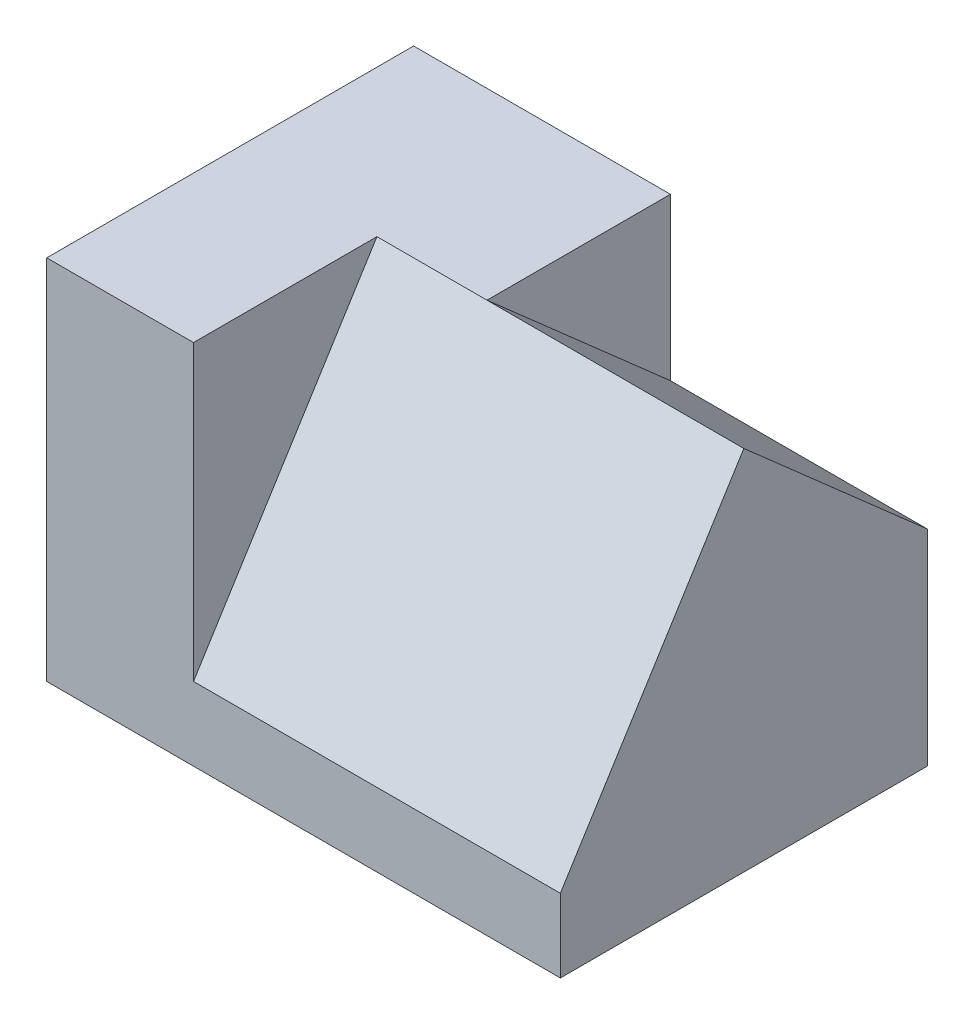
ISO-10303-21;
HEADER;
FILE_DESCRIPTION(('STEP AP214'),'2;1');
FILE_NAME('part.step','',(''),(''),'','','');
FILE_SCHEMA(('AUTOMOTIVE_DESIGN { 1 0 10303 214 1 1 1 1 }'));
ENDSEC;
DATA;
#1=APPLICATION_CONTEXT('core data for automotive mechanical design processes');
#2=APPLICATION_PROTOCOL_DEFINITION('international standard','automotive_design',2000,#1);
#3=PRODUCT_CONTEXT('',#1,'mechanical');
#4=PRODUCT('Part','Part','',(#3));
#5=PRODUCT_RELATED_PRODUCT_CATEGORY('part','',(#4));
#6=PRODUCT_DEFINITION_FORMATION('','',#4);
#7=PRODUCT_DEFINITION_CONTEXT('part definition',#1,'design');
#8=PRODUCT_DEFINITION('design','',#6,#7);
#9=PRODUCT_DEFINITION_SHAPE('','',#8);
#10=(LENGTH_UNIT() NAMED_UNIT(*) SI_UNIT(.MILLI.,.METRE.));
#11=(NAMED_UNIT(*) PLANE_ANGLE_UNIT() SI_UNIT($,.RADIAN.));
#12=(NAMED_UNIT(*) SI_UNIT($,.STERADIAN.) SOLID_ANGLE_UNIT());
#13=UNCERTAINTY_MEASURE_WITH_UNIT(LENGTH_MEASURE(1.E-05),#10,'distance_accuracy_value','');
#14=(GEOMETRIC_REPRESENTATION_CONTEXT(3) GLOBAL_UNCERTAINTY_ASSIGNED_CONTEXT((#13)) GLOBAL_UNIT_ASSIGNED_CONTEXT((#10,
#11,#12)) REPRESENTATION_CONTEXT('',''));
#15=CARTESIAN_POINT('',(0.,0.,0.));
#16=DIRECTION('',(0.,0.,1.));
#17=DIRECTION('',(1.,0.,0.));
#18=AXIS2_PLACEMENT_3D('',#15,#16,#17);
#19=CARTESIAN_POINT('',(0.,500.,-500.));
#20=DIRECTION('',(0.,0.,-1.));
#21=DIRECTION('',(-1.,0.,0.));
#22=AXIS2_PLACEMENT_3D('',#19,#20,#21);
#23=PLANE('',#22);
#24=DIRECTION('',(0.,-1.,0.));
#25=VECTOR('',#24,1.);
#26=CARTESIAN_POINT('',(350.,500.,-500.));
#27=LINE('',#26,#25);
#28=CARTESIAN_POINT('',(350.,500.,-500.));
#29=VERTEX_POINT('',#28);
#30=CARTESIAN_POINT('',(350.,280.,-500.));
#31=VERTEX_POINT('',#30);
#32=EDGE_CURVE('E104',#29,#31,#27,.T.);
#33=ORIENTED_EDGE('',*,*,#32,.T.);
#34=DIRECTION('',(-1.,0.,0.));
#35=VECTOR('',#34,1.);
#36=CARTESIAN_POINT('',(2818.73429638328,280.,-500.));
#37=LINE('',#36,#35);
#38=CARTESIAN_POINT('',(700.,280.,-500.));
#39=VERTEX_POINT('',#38);
#40=EDGE_CURVE('E141',#39,#31,#37,.T.);
#41=ORIENTED_EDGE('',*,*,#40,.F.);
#42=DIRECTION('',(0.,-1.,0.));
#43=VECTOR('',#42,1.);
#44=CARTESIAN_POINT('',(700.,500.,-500.));
#45=LINE('',#44,#43);
#46=CARTESIAN_POINT('',(700.,0.,-500.));
#47=VERTEX_POINT('',#46);
#48=EDGE_CURVE('E103',#39,#47,#45,.T.);
#49=ORIENTED_EDGE('',*,*,#48,.T.);
#50=DIRECTION('',(1.,0.,0.));
#51=VECTOR('',#50,1.);
#52=CARTESIAN_POINT('',(0.,0.,-500.));
#53=LINE('',#52,#51);
#54=CARTESIAN_POINT('',(0.,0.,-500.));
#55=VERTEX_POINT('',#54);
#56=EDGE_CURVE('E108',#55,#47,#53,.T.);
#57=ORIENTED_EDGE('',*,*,#56,.F.);
#58=DIRECTION('',(0.,-1.,0.));
#59=VECTOR('',#58,1.);
#60=CARTESIAN_POINT('',(0.,500.,-500.));
#61=LINE('',#60,#59);
#62=CARTESIAN_POINT('',(0.,500.,-500.));
#63=VERTEX_POINT('',#62);
#64=EDGE_CURVE('E133',#63,#55,#61,.T.);
#65=ORIENTED_EDGE('',*,*,#64,.F.);
#66=DIRECTION('',(1.,0.,0.));
#67=VECTOR('',#66,1.);
#68=CARTESIAN_POINT('',(0.,500.,-500.));
#69=LINE('',#68,#67);
#70=EDGE_CURVE('E117',#63,#29,#69,.T.);
#71=ORIENTED_EDGE('',*,*,#70,.T.);
#72=EDGE_LOOP('',(#33,#41,#49,#57,#65,#71));
#73=FACE_BOUND('',#72,.T.);
#74=ADVANCED_FACE('F33',(#73),#23,.T.);
#75=CARTESIAN_POINT('',(700.,500.,0.));
#76=DIRECTION('',(-1.,0.,0.));
#77=DIRECTION('',(0.,0.,1.));
#78=AXIS2_PLACEMENT_3D('',#75,#76,#77);
#79=PLANE('',#78);
#80=DIRECTION('',(0.,0.660627894892025,0.750713516922755));
#81=VECTOR('',#80,1.);
#82=CARTESIAN_POINT('',(700.,500.,-250.));
#83=LINE('',#82,#81);
#84=CARTESIAN_POINT('',(700.,500.,-250.));
#85=VERTEX_POINT('',#84);
#86=EDGE_CURVE('E93',#39,#85,#83,.T.);
#87=ORIENTED_EDGE('',*,*,#86,.T.);
#88=DIRECTION('',(0.,-0.847998304005088,0.52999894000318));
#89=VECTOR('',#88,1.);
#90=CARTESIAN_POINT('',(700.,387.640449438202,-179.775280898876));
#91=LINE('',#90,#89);
#92=CARTESIAN_POINT('',(700.,99.9999999999999,0.));
#93=VERTEX_POINT('',#92);
#94=EDGE_CURVE('E100',#85,#93,#91,.T.);
#95=ORIENTED_EDGE('',*,*,#94,.T.);
#96=DIRECTION('',(0.,-1.,0.));
#97=VECTOR('',#96,1.);
#98=CARTESIAN_POINT('',(700.,500.,0.));
#99=LINE('',#98,#97);
#100=CARTESIAN_POINT('',(700.,0.,0.));
#101=VERTEX_POINT('',#100);
#102=EDGE_CURVE('E137',#93,#101,#99,.T.);
#103=ORIENTED_EDGE('',*,*,#102,.T.);
#104=DIRECTION('',(0.,0.,-1.));
#105=VECTOR('',#104,1.);
#106=CARTESIAN_POINT('',(700.,0.,0.));
#107=LINE('',#106,#105);
#108=EDGE_CURVE('E111',#101,#47,#107,.T.);
#109=ORIENTED_EDGE('',*,*,#108,.T.);
#110=ORIENTED_EDGE('',*,*,#48,.F.);
#111=EDGE_LOOP('',(#87,#95,#103,#109,#110));
#112=FACE_BOUND('',#111,.T.);
#113=ADVANCED_FACE('F99',(#112),#79,.F.);
#114=CARTESIAN_POINT('',(0.,500.,0.));
#115=DIRECTION('',(-1.,0.,0.));
#116=DIRECTION('',(0.,0.,1.));
#117=AXIS2_PLACEMENT_3D('',#114,#115,#116);
#118=PLANE('',#117);
#119=DIRECTION('',(0.,0.,-1.));
#120=VECTOR('',#119,1.);
#121=CARTESIAN_POINT('',(0.,0.,0.));
#122=LINE('',#121,#120);
#123=CARTESIAN_POINT('',(0.,0.,0.));
#124=VERTEX_POINT('',#123);
#125=EDGE_CURVE('E121',#124,#55,#122,.T.);
#126=ORIENTED_EDGE('',*,*,#125,.F.);
#127=DIRECTION('',(0.,-1.,0.));
#128=VECTOR('',#127,1.);
#129=CARTESIAN_POINT('',(0.,500.,0.));
#130=LINE('',#129,#128);
#131=CARTESIAN_POINT('',(0.,500.,0.));
#132=VERTEX_POINT('',#131);
#133=EDGE_CURVE('E135',#132,#124,#130,.T.);
#134=ORIENTED_EDGE('',*,*,#133,.F.);
#135=DIRECTION('',(0.,0.,-1.));
#136=VECTOR('',#135,1.);
#137=CARTESIAN_POINT('',(0.,500.,0.));
#138=LINE('',#137,#136);
#139=EDGE_CURVE('E124',#132,#63,#138,.T.);
#140=ORIENTED_EDGE('',*,*,#139,.T.);
#141=ORIENTED_EDGE('',*,*,#64,.T.);
#142=EDGE_LOOP('',(#126,#134,#140,#141));
#143=FACE_BOUND('',#142,.T.);
#144=ADVANCED_FACE('F148',(#143),#118,.T.);
#145=CARTESIAN_POINT('',(0.,500.,0.));
#146=DIRECTION('',(0.,0.,-1.));
#147=DIRECTION('',(-1.,0.,0.));
#148=AXIS2_PLACEMENT_3D('',#145,#146,#147);
#149=PLANE('',#148);
#150=ORIENTED_EDGE('',*,*,#102,.F.);
#151=DIRECTION('',(-1.,0.,0.));
#152=VECTOR('',#151,1.);
#153=CARTESIAN_POINT('',(700.000012,99.9999999999999,0.));
#154=LINE('',#153,#152);
#155=CARTESIAN_POINT('',(200.,99.9999999999999,0.));
#156=VERTEX_POINT('',#155);
#157=EDGE_CURVE('E107',#93,#156,#154,.T.);
#158=ORIENTED_EDGE('',*,*,#157,.T.);
#159=DIRECTION('',(0.,-1.,0.));
#160=VECTOR('',#159,1.);
#161=CARTESIAN_POINT('',(200.,0.,0.));
#162=LINE('',#161,#160);
#163=CARTESIAN_POINT('',(200.,500.,0.));
#164=VERTEX_POINT('',#163);
#165=EDGE_CURVE('E113',#164,#156,#162,.T.);
#166=ORIENTED_EDGE('',*,*,#165,.F.);
#167=DIRECTION('',(1.,0.,0.));
#168=VECTOR('',#167,1.);
#169=CARTESIAN_POINT('',(0.,500.,0.));
#170=LINE('',#169,#168);
#171=EDGE_CURVE('E120',#132,#164,#170,.T.);
#172=ORIENTED_EDGE('',*,*,#171,.F.);
#173=ORIENTED_EDGE('',*,*,#133,.T.);
#174=DIRECTION('',(1.,0.,0.));
#175=VECTOR('',#174,1.);
#176=CARTESIAN_POINT('',(0.,0.,0.));
#177=LINE('',#176,#175);
#178=EDGE_CURVE('E128',#124,#101,#177,.T.);
#179=ORIENTED_EDGE('',*,*,#178,.T.);
#180=EDGE_LOOP('',(#150,#158,#166,#172,#173,#179));
#181=FACE_BOUND('',#180,.T.);
#182=ADVANCED_FACE('F170',(#181),#149,.F.);
#183=CARTESIAN_POINT('',(0.,500.,0.));
#184=DIRECTION('',(0.,1.,0.));
#185=DIRECTION('',(0.,0.,1.));
#186=AXIS2_PLACEMENT_3D('',#183,#184,#185);
#187=PLANE('',#186);
#188=DIRECTION('',(0.,0.,-1.));
#189=VECTOR('',#188,1.);
#190=CARTESIAN_POINT('',(350.,500.,0.));
#191=LINE('',#190,#189);
#192=CARTESIAN_POINT('',(350.,500.,-250.));
#193=VERTEX_POINT('',#192);
#194=EDGE_CURVE('E155',#193,#29,#191,.T.);
#195=ORIENTED_EDGE('',*,*,#194,.T.);
#196=ORIENTED_EDGE('',*,*,#70,.F.);
#197=ORIENTED_EDGE('',*,*,#139,.F.);
#198=ORIENTED_EDGE('',*,*,#171,.T.);
#199=DIRECTION('',(0.,0.,1.));
#200=VECTOR('',#199,1.);
#201=CARTESIAN_POINT('',(200.,500.,0.));
#202=LINE('',#201,#200);
#203=CARTESIAN_POINT('',(200.,500.,-250.));
#204=VERTEX_POINT('',#203);
#205=EDGE_CURVE('E164',#204,#164,#202,.T.);
#206=ORIENTED_EDGE('',*,*,#205,.F.);
#207=DIRECTION('',(-1.,0.,0.));
#208=VECTOR('',#207,1.);
#209=CARTESIAN_POINT('',(0.,500.,-250.));
#210=LINE('',#209,#208);
#211=EDGE_CURVE('E40',#193,#204,#210,.T.);
#212=ORIENTED_EDGE('',*,*,#211,.F.);
#213=EDGE_LOOP('',(#195,#196,#197,#198,#206,#212));
#214=FACE_BOUND('',#213,.T.);
#215=ADVANCED_FACE('F154',(#214),#187,.T.);
#216=CARTESIAN_POINT('',(0.,0.,0.));
#217=DIRECTION('',(0.,1.,0.));
#218=DIRECTION('',(0.,0.,1.));
#219=AXIS2_PLACEMENT_3D('',#216,#217,#218);
#220=PLANE('',#219);
#221=ORIENTED_EDGE('',*,*,#56,.T.);
#222=ORIENTED_EDGE('',*,*,#108,.F.);
#223=ORIENTED_EDGE('',*,*,#178,.F.);
#224=ORIENTED_EDGE('',*,*,#125,.T.);
#225=EDGE_LOOP('',(#221,#222,#223,#224));
#226=FACE_BOUND('',#225,.T.);
#227=ADVANCED_FACE('F145',(#226),#220,.F.);
#228=CARTESIAN_POINT('',(700.000012,28.0898876404494,44.9438202247191));
#229=DIRECTION('',(0.,-0.52999894000318,-0.847998304005088));
#230=DIRECTION('',(0.,0.847998304005088,-0.52999894000318));
#231=AXIS2_PLACEMENT_3D('',#228,#229,#230);
#232=PLANE('',#231);
#233=EDGE_CURVE('E11',#85,#193,#210,.T.);
#234=ORIENTED_EDGE('',*,*,#233,.T.);
#235=ORIENTED_EDGE('',*,*,#211,.T.);
#236=DIRECTION('',(0.,-0.847998304005088,0.52999894000318));
#237=VECTOR('',#236,1.);
#238=CARTESIAN_POINT('',(200.,28.0898876404494,44.9438202247191));
#239=LINE('',#238,#237);
#240=EDGE_CURVE('E162',#204,#156,#239,.T.);
#241=ORIENTED_EDGE('',*,*,#240,.T.);
#242=ORIENTED_EDGE('',*,*,#157,.F.);
#243=ORIENTED_EDGE('',*,*,#94,.F.);
#244=EDGE_LOOP('',(#234,#235,#241,#242,#243));
#245=FACE_BOUND('',#244,.T.);
#246=ADVANCED_FACE('F106',(#245),#232,.F.);
#247=CARTESIAN_POINT('',(200.,0.,0.));
#248=DIRECTION('',(1.,0.,0.));
#249=DIRECTION('',(0.,0.,-1.));
#250=AXIS2_PLACEMENT_3D('',#247,#248,#249);
#251=PLANE('',#250);
#252=ORIENTED_EDGE('',*,*,#240,.F.);
#253=ORIENTED_EDGE('',*,*,#205,.T.);
#254=ORIENTED_EDGE('',*,*,#165,.T.);
#255=EDGE_LOOP('',(#252,#253,#254));
#256=FACE_BOUND('',#255,.T.);
#257=ADVANCED_FACE('F168',(#256),#251,.T.);
#258=CARTESIAN_POINT('',(2818.73429638328,500.,-250.));
#259=DIRECTION('',(0.,0.750713516922755,-0.660627894892025));
#260=DIRECTION('',(0.,0.660627894892025,0.750713516922755));
#261=AXIS2_PLACEMENT_3D('',#258,#259,#260);
#262=PLANE('',#261);
#263=ORIENTED_EDGE('',*,*,#86,.F.);
#264=ORIENTED_EDGE('',*,*,#40,.T.);
#265=DIRECTION('',(0.,0.660627894892025,0.750713516922755));
#266=VECTOR('',#265,1.);
#267=CARTESIAN_POINT('',(350.,500.,-250.));
#268=LINE('',#267,#266);
#269=EDGE_CURVE('E47',#31,#193,#268,.T.);
#270=ORIENTED_EDGE('',*,*,#269,.T.);
#271=ORIENTED_EDGE('',*,*,#233,.F.);
#272=EDGE_LOOP('',(#263,#264,#270,#271));
#273=FACE_BOUND('',#272,.T.);
#274=ADVANCED_FACE('F92',(#273),#262,.T.);
#275=CARTESIAN_POINT('',(350.,500.,0.));
#276=DIRECTION('',(-1.,0.,0.));
#277=DIRECTION('',(0.,0.,1.));
#278=AXIS2_PLACEMENT_3D('',#275,#276,#277);
#279=PLANE('',#278);
#280=ORIENTED_EDGE('',*,*,#194,.F.);
#281=ORIENTED_EDGE('',*,*,#269,.F.);
#282=ORIENTED_EDGE('',*,*,#32,.F.);
#283=EDGE_LOOP('',(#280,#281,#282));
#284=FACE_BOUND('',#283,.T.);
#285=ADVANCED_FACE('F225',(#284),#279,.F.);
#286=CLOSED_SHELL('',(#74,#113,#144,#182,#215,#227,#246,#257,#274,#285));
#287=MANIFOLD_SOLID_BREP('B2',#286);
#288=ADVANCED_BREP_SHAPE_REPRESENTATION('',(#18,#287),#14);
#289=SHAPE_DEFINITION_REPRESENTATION(#9,#288);
ENDSEC;
END-ISO-10303-21;
